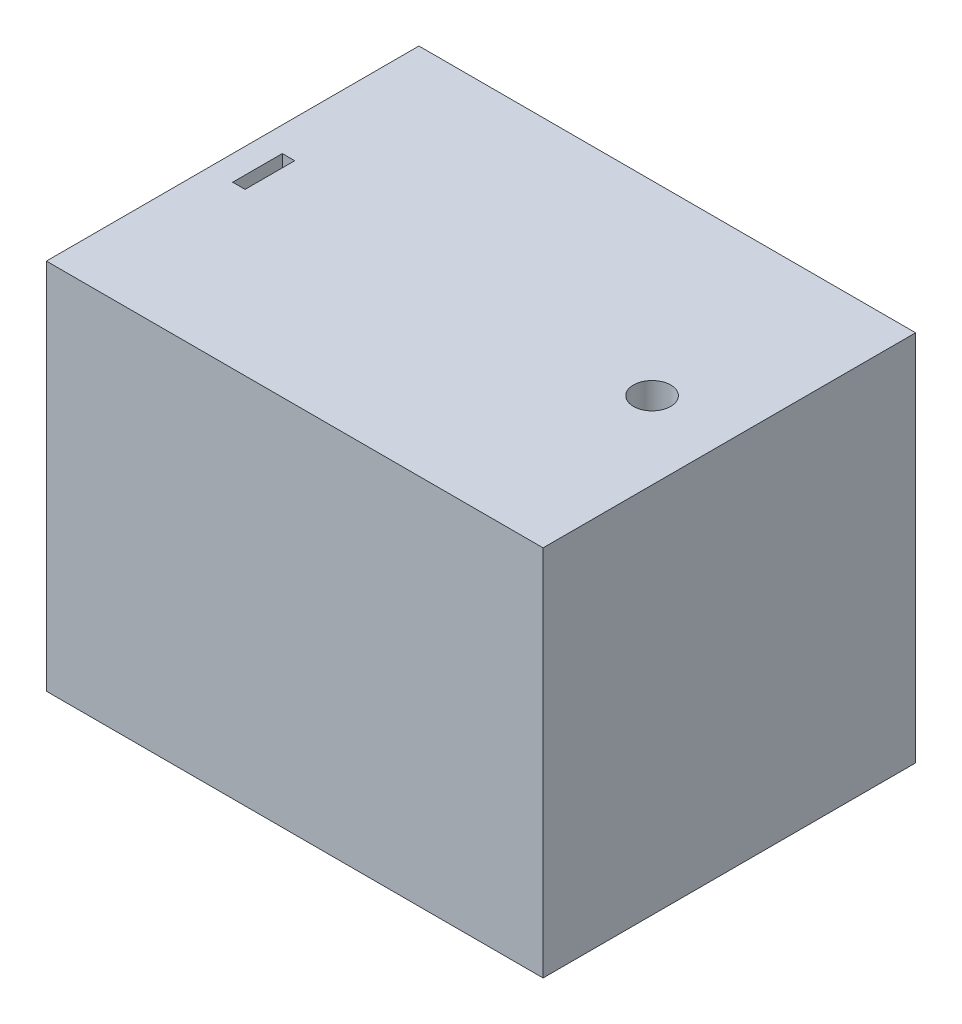
ISO-10303-21;
HEADER;
FILE_DESCRIPTION(('STEP AP214'),'2;1');
FILE_NAME('part.step','',(''),(''),'','','');
FILE_SCHEMA(('AUTOMOTIVE_DESIGN { 1 0 10303 214 1 1 1 1 }'));
ENDSEC;
DATA;
#1=APPLICATION_CONTEXT('core data for automotive mechanical design processes');
#2=APPLICATION_PROTOCOL_DEFINITION('international standard','automotive_design',2000,#1);
#3=PRODUCT_CONTEXT('',#1,'mechanical');
#4=PRODUCT('Part','Part','',(#3));
#5=PRODUCT_RELATED_PRODUCT_CATEGORY('part','',(#4));
#6=PRODUCT_DEFINITION_FORMATION('','',#4);
#7=PRODUCT_DEFINITION_CONTEXT('part definition',#1,'design');
#8=PRODUCT_DEFINITION('design','',#6,#7);
#9=PRODUCT_DEFINITION_SHAPE('','',#8);
#10=(LENGTH_UNIT() NAMED_UNIT(*) SI_UNIT(.MILLI.,.METRE.));
#11=(NAMED_UNIT(*) PLANE_ANGLE_UNIT() SI_UNIT($,.RADIAN.));
#12=(NAMED_UNIT(*) SI_UNIT($,.STERADIAN.) SOLID_ANGLE_UNIT());
#13=UNCERTAINTY_MEASURE_WITH_UNIT(LENGTH_MEASURE(1.E-05),#10,'distance_accuracy_value','');
#14=(GEOMETRIC_REPRESENTATION_CONTEXT(3) GLOBAL_UNCERTAINTY_ASSIGNED_CONTEXT((#13)) GLOBAL_UNIT_ASSIGNED_CONTEXT((#10,
#11,#12)) REPRESENTATION_CONTEXT('',''));
#15=CARTESIAN_POINT('',(0.,0.,0.));
#16=DIRECTION('',(0.,0.,1.));
#17=DIRECTION('',(1.,0.,0.));
#18=AXIS2_PLACEMENT_3D('',#15,#16,#17);
#19=CARTESIAN_POINT('',(0.,15.,0.));
#20=DIRECTION('',(1.,0.,0.));
#21=DIRECTION('',(0.,0.,-1.));
#22=AXIS2_PLACEMENT_3D('',#19,#20,#21);
#23=PLANE('',#22);
#24=DIRECTION('',(0.,0.,1.));
#25=VECTOR('',#24,1.);
#26=CARTESIAN_POINT('',(0.,0.,0.));
#27=LINE('',#26,#25);
#28=CARTESIAN_POINT('',(0.,0.,0.));
#29=VERTEX_POINT('',#28);
#30=CARTESIAN_POINT('',(0.,0.,15.));
#31=VERTEX_POINT('',#30);
#32=EDGE_CURVE('E167',#29,#31,#27,.T.);
#33=ORIENTED_EDGE('',*,*,#32,.T.);
#34=DIRECTION('',(0.,-1.,0.));
#35=VECTOR('',#34,1.);
#36=CARTESIAN_POINT('',(0.,15.,15.));
#37=LINE('',#36,#35);
#38=CARTESIAN_POINT('',(0.,15.,15.));
#39=VERTEX_POINT('',#38);
#40=EDGE_CURVE('E11',#39,#31,#37,.T.);
#41=ORIENTED_EDGE('',*,*,#40,.F.);
#42=DIRECTION('',(0.,0.,1.));
#43=VECTOR('',#42,1.);
#44=CARTESIAN_POINT('',(0.,15.,0.));
#45=LINE('',#44,#43);
#46=CARTESIAN_POINT('',(0.,15.,0.));
#47=VERTEX_POINT('',#46);
#48=EDGE_CURVE('E171',#47,#39,#45,.T.);
#49=ORIENTED_EDGE('',*,*,#48,.F.);
#50=DIRECTION('',(0.,-1.,0.));
#51=VECTOR('',#50,1.);
#52=CARTESIAN_POINT('',(0.,15.,0.));
#53=LINE('',#52,#51);
#54=EDGE_CURVE('E181',#47,#29,#53,.T.);
#55=ORIENTED_EDGE('',*,*,#54,.T.);
#56=EDGE_LOOP('',(#33,#41,#49,#55));
#57=FACE_BOUND('',#56,.T.);
#58=ADVANCED_FACE('F39',(#57),#23,.F.);
#59=CARTESIAN_POINT('',(0.,15.,15.));
#60=DIRECTION('',(0.,0.,-1.));
#61=DIRECTION('',(-1.,0.,0.));
#62=AXIS2_PLACEMENT_3D('',#59,#60,#61);
#63=PLANE('',#62);
#64=DIRECTION('',(1.,0.,0.));
#65=VECTOR('',#64,1.);
#66=CARTESIAN_POINT('',(0.,0.,15.));
#67=LINE('',#66,#65);
#68=CARTESIAN_POINT('',(20.,0.,15.));
#69=VERTEX_POINT('',#68);
#70=EDGE_CURVE('E185',#31,#69,#67,.T.);
#71=ORIENTED_EDGE('',*,*,#70,.T.);
#72=DIRECTION('',(0.,-1.,0.));
#73=VECTOR('',#72,1.);
#74=CARTESIAN_POINT('',(20.,15.,15.));
#75=LINE('',#74,#73);
#76=CARTESIAN_POINT('',(20.,15.,15.));
#77=VERTEX_POINT('',#76);
#78=EDGE_CURVE('E47',#77,#69,#75,.T.);
#79=ORIENTED_EDGE('',*,*,#78,.F.);
#80=DIRECTION('',(1.,0.,0.));
#81=VECTOR('',#80,1.);
#82=CARTESIAN_POINT('',(0.,15.,15.));
#83=LINE('',#82,#81);
#84=EDGE_CURVE('E91',#39,#77,#83,.T.);
#85=ORIENTED_EDGE('',*,*,#84,.F.);
#86=ORIENTED_EDGE('',*,*,#40,.T.);
#87=EDGE_LOOP('',(#71,#79,#85,#86));
#88=FACE_BOUND('',#87,.T.);
#89=ADVANCED_FACE('F220',(#88),#63,.F.);
#90=CARTESIAN_POINT('',(20.,15.,0.));
#91=DIRECTION('',(-1.,0.,0.));
#92=DIRECTION('',(0.,0.,1.));
#93=AXIS2_PLACEMENT_3D('',#90,#91,#92);
#94=PLANE('',#93);
#95=DIRECTION('',(0.,0.,-1.));
#96=VECTOR('',#95,1.);
#97=CARTESIAN_POINT('',(20.,0.,0.));
#98=LINE('',#97,#96);
#99=CARTESIAN_POINT('',(20.,0.,0.));
#100=VERTEX_POINT('',#99);
#101=EDGE_CURVE('E188',#69,#100,#98,.T.);
#102=ORIENTED_EDGE('',*,*,#101,.T.);
#103=DIRECTION('',(0.,-1.,0.));
#104=VECTOR('',#103,1.);
#105=CARTESIAN_POINT('',(20.,15.,0.));
#106=LINE('',#105,#104);
#107=CARTESIAN_POINT('',(20.,15.,0.));
#108=VERTEX_POINT('',#107);
#109=EDGE_CURVE('E195',#108,#100,#106,.T.);
#110=ORIENTED_EDGE('',*,*,#109,.F.);
#111=DIRECTION('',(0.,0.,-1.));
#112=VECTOR('',#111,1.);
#113=CARTESIAN_POINT('',(20.,15.,0.));
#114=LINE('',#113,#112);
#115=EDGE_CURVE('E176',#77,#108,#114,.T.);
#116=ORIENTED_EDGE('',*,*,#115,.F.);
#117=ORIENTED_EDGE('',*,*,#78,.T.);
#118=EDGE_LOOP('',(#102,#110,#116,#117));
#119=FACE_BOUND('',#118,.T.);
#120=ADVANCED_FACE('F202',(#119),#94,.F.);
#121=CARTESIAN_POINT('',(0.,15.,0.));
#122=DIRECTION('',(0.,0.,1.));
#123=DIRECTION('',(1.,0.,0.));
#124=AXIS2_PLACEMENT_3D('',#121,#122,#123);
#125=PLANE('',#124);
#126=DIRECTION('',(-1.,0.,0.));
#127=VECTOR('',#126,1.);
#128=CARTESIAN_POINT('',(0.,0.,0.));
#129=LINE('',#128,#127);
#130=EDGE_CURVE('E84',#100,#29,#129,.T.);
#131=ORIENTED_EDGE('',*,*,#130,.T.);
#132=ORIENTED_EDGE('',*,*,#54,.F.);
#133=DIRECTION('',(-1.,0.,0.));
#134=VECTOR('',#133,1.);
#135=CARTESIAN_POINT('',(0.,15.,0.));
#136=LINE('',#135,#134);
#137=EDGE_CURVE('E63',#108,#47,#136,.T.);
#138=ORIENTED_EDGE('',*,*,#137,.F.);
#139=ORIENTED_EDGE('',*,*,#109,.T.);
#140=EDGE_LOOP('',(#131,#132,#138,#139));
#141=FACE_BOUND('',#140,.T.);
#142=ADVANCED_FACE('F210',(#141),#125,.F.);
#143=CARTESIAN_POINT('',(0.,15.,0.));
#144=DIRECTION('',(0.,1.,0.));
#145=DIRECTION('',(0.,0.,1.));
#146=AXIS2_PLACEMENT_3D('',#143,#144,#145);
#147=PLANE('',#146);
#148=DIRECTION('',(0.,0.,1.));
#149=VECTOR('',#148,1.);
#150=CARTESIAN_POINT('',(1.,15.,6.5));
#151=LINE('',#150,#149);
#152=CARTESIAN_POINT('',(1.,15.,6.5));
#153=VERTEX_POINT('',#152);
#154=CARTESIAN_POINT('',(1.,15.,8.5));
#155=VERTEX_POINT('',#154);
#156=EDGE_CURVE('E54',#153,#155,#151,.T.);
#157=ORIENTED_EDGE('',*,*,#156,.F.);
#158=DIRECTION('',(1.,0.,0.));
#159=VECTOR('',#158,1.);
#160=CARTESIAN_POINT('',(1.,15.,6.5));
#161=LINE('',#160,#159);
#162=CARTESIAN_POINT('',(1.5,15.,6.5));
#163=VERTEX_POINT('',#162);
#164=EDGE_CURVE('E135',#153,#163,#161,.T.);
#165=ORIENTED_EDGE('',*,*,#164,.T.);
#166=DIRECTION('',(0.,0.,1.));
#167=VECTOR('',#166,1.);
#168=CARTESIAN_POINT('',(1.5,15.,6.5));
#169=LINE('',#168,#167);
#170=CARTESIAN_POINT('',(1.5,15.,8.5));
#171=VERTEX_POINT('',#170);
#172=EDGE_CURVE('E139',#163,#171,#169,.T.);
#173=ORIENTED_EDGE('',*,*,#172,.T.);
#174=DIRECTION('',(1.,0.,0.));
#175=VECTOR('',#174,1.);
#176=CARTESIAN_POINT('',(1.,15.,8.5));
#177=LINE('',#176,#175);
#178=EDGE_CURVE('E148',#155,#171,#177,.T.);
#179=ORIENTED_EDGE('',*,*,#178,.F.);
#180=EDGE_LOOP('',(#157,#165,#173,#179));
#181=FACE_BOUND('',#180,.T.);
#182=CARTESIAN_POINT('',(16.8886235381611,15.,7.5));
#183=DIRECTION('',(0.,1.,0.));
#184=DIRECTION('',(0.,0.,1.));
#185=AXIS2_PLACEMENT_3D('',#182,#183,#184);
#186=CIRCLE('',#185,0.750000000000002);
#187=CARTESIAN_POINT('',(16.8886235381611,15.,8.25));
#188=VERTEX_POINT('',#187);
#189=EDGE_CURVE('E157',#188,#188,#186,.T.);
#190=ORIENTED_EDGE('',*,*,#189,.F.);
#191=EDGE_LOOP('',(#190));
#192=FACE_BOUND('',#191,.T.);
#193=ORIENTED_EDGE('',*,*,#48,.T.);
#194=ORIENTED_EDGE('',*,*,#84,.T.);
#195=ORIENTED_EDGE('',*,*,#115,.T.);
#196=ORIENTED_EDGE('',*,*,#137,.T.);
#197=EDGE_LOOP('',(#193,#194,#195,#196));
#198=FACE_BOUND('',#197,.T.);
#199=ADVANCED_FACE('F212',(#181,#192,#198),#147,.T.);
#200=CARTESIAN_POINT('',(0.,0.,0.));
#201=DIRECTION('',(0.,1.,0.));
#202=DIRECTION('',(0.,0.,1.));
#203=AXIS2_PLACEMENT_3D('',#200,#201,#202);
#204=PLANE('',#203);
#205=CARTESIAN_POINT('',(16.8886235381611,0.,7.5));
#206=DIRECTION('',(0.,1.,0.));
#207=DIRECTION('',(0.,0.,1.));
#208=AXIS2_PLACEMENT_3D('',#205,#206,#207);
#209=CIRCLE('',#208,0.750000000000002);
#210=CARTESIAN_POINT('',(16.8886235381611,0.,8.25));
#211=VERTEX_POINT('',#210);
#212=EDGE_CURVE('E163',#211,#211,#209,.T.);
#213=ORIENTED_EDGE('',*,*,#212,.T.);
#214=EDGE_LOOP('',(#213));
#215=FACE_BOUND('',#214,.T.);
#216=ORIENTED_EDGE('',*,*,#32,.F.);
#217=ORIENTED_EDGE('',*,*,#130,.F.);
#218=ORIENTED_EDGE('',*,*,#101,.F.);
#219=ORIENTED_EDGE('',*,*,#70,.F.);
#220=EDGE_LOOP('',(#216,#217,#218,#219));
#221=FACE_BOUND('',#220,.T.);
#222=ADVANCED_FACE('F206',(#215,#221),#204,.F.);
#223=CARTESIAN_POINT('',(16.8886235381611,0.,7.5));
#224=DIRECTION('',(0.,1.,0.));
#225=DIRECTION('',(0.,0.,1.));
#226=AXIS2_PLACEMENT_3D('',#223,#224,#225);
#227=CYLINDRICAL_SURFACE('',#226,0.750000000000002);
#228=ORIENTED_EDGE('',*,*,#212,.F.);
#229=EDGE_LOOP('',(#228));
#230=FACE_BOUND('',#229,.T.);
#231=ORIENTED_EDGE('',*,*,#189,.T.);
#232=EDGE_LOOP('',(#231));
#233=FACE_BOUND('',#232,.T.);
#234=ADVANCED_FACE('F247',(#230,#233),#227,.F.);
#235=CARTESIAN_POINT('',(1.,8.,6.5));
#236=DIRECTION('',(-1.,0.,0.));
#237=DIRECTION('',(0.,0.,1.));
#238=AXIS2_PLACEMENT_3D('',#235,#236,#237);
#239=PLANE('',#238);
#240=ORIENTED_EDGE('',*,*,#156,.T.);
#241=DIRECTION('',(0.,1.,0.));
#242=VECTOR('',#241,1.);
#243=CARTESIAN_POINT('',(1.,8.,8.5));
#244=LINE('',#243,#242);
#245=CARTESIAN_POINT('',(1.,8.,8.5));
#246=VERTEX_POINT('',#245);
#247=EDGE_CURVE('E111',#246,#155,#244,.T.);
#248=ORIENTED_EDGE('',*,*,#247,.F.);
#249=DIRECTION('',(0.,0.,1.));
#250=VECTOR('',#249,1.);
#251=CARTESIAN_POINT('',(1.,8.,6.5));
#252=LINE('',#251,#250);
#253=CARTESIAN_POINT('',(1.,8.,6.5));
#254=VERTEX_POINT('',#253);
#255=EDGE_CURVE('E115',#254,#246,#252,.T.);
#256=ORIENTED_EDGE('',*,*,#255,.F.);
#257=DIRECTION('',(0.,1.,0.));
#258=VECTOR('',#257,1.);
#259=CARTESIAN_POINT('',(1.,8.,6.5));
#260=LINE('',#259,#258);
#261=EDGE_CURVE('E154',#254,#153,#260,.T.);
#262=ORIENTED_EDGE('',*,*,#261,.T.);
#263=EDGE_LOOP('',(#240,#248,#256,#262));
#264=FACE_BOUND('',#263,.T.);
#265=ADVANCED_FACE('F113',(#264),#239,.F.);
#266=CARTESIAN_POINT('',(1.,8.,6.5));
#267=DIRECTION('',(0.,0.,1.));
#268=DIRECTION('',(1.,0.,0.));
#269=AXIS2_PLACEMENT_3D('',#266,#267,#268);
#270=PLANE('',#269);
#271=ORIENTED_EDGE('',*,*,#164,.F.);
#272=ORIENTED_EDGE('',*,*,#261,.F.);
#273=DIRECTION('',(1.,0.,0.));
#274=VECTOR('',#273,1.);
#275=CARTESIAN_POINT('',(1.,8.,6.5));
#276=LINE('',#275,#274);
#277=CARTESIAN_POINT('',(1.5,8.,6.5));
#278=VERTEX_POINT('',#277);
#279=EDGE_CURVE('E121',#254,#278,#276,.T.);
#280=ORIENTED_EDGE('',*,*,#279,.T.);
#281=DIRECTION('',(0.,1.,0.));
#282=VECTOR('',#281,1.);
#283=CARTESIAN_POINT('',(1.5,8.,6.5));
#284=LINE('',#283,#282);
#285=EDGE_CURVE('E158',#278,#163,#284,.T.);
#286=ORIENTED_EDGE('',*,*,#285,.T.);
#287=EDGE_LOOP('',(#271,#272,#280,#286));
#288=FACE_BOUND('',#287,.T.);
#289=ADVANCED_FACE('F270',(#288),#270,.T.);
#290=CARTESIAN_POINT('',(1.5,8.,6.5));
#291=DIRECTION('',(-1.,0.,0.));
#292=DIRECTION('',(0.,0.,1.));
#293=AXIS2_PLACEMENT_3D('',#290,#291,#292);
#294=PLANE('',#293);
#295=ORIENTED_EDGE('',*,*,#172,.F.);
#296=ORIENTED_EDGE('',*,*,#285,.F.);
#297=DIRECTION('',(0.,0.,1.));
#298=VECTOR('',#297,1.);
#299=CARTESIAN_POINT('',(1.5,8.,6.5));
#300=LINE('',#299,#298);
#301=CARTESIAN_POINT('',(1.5,8.,8.5));
#302=VERTEX_POINT('',#301);
#303=EDGE_CURVE('E130',#278,#302,#300,.T.);
#304=ORIENTED_EDGE('',*,*,#303,.T.);
#305=DIRECTION('',(0.,1.,0.));
#306=VECTOR('',#305,1.);
#307=CARTESIAN_POINT('',(1.5,8.,8.5));
#308=LINE('',#307,#306);
#309=EDGE_CURVE('E120',#302,#171,#308,.T.);
#310=ORIENTED_EDGE('',*,*,#309,.T.);
#311=EDGE_LOOP('',(#295,#296,#304,#310));
#312=FACE_BOUND('',#311,.T.);
#313=ADVANCED_FACE('F279',(#312),#294,.T.);
#314=CARTESIAN_POINT('',(1.,8.,8.5));
#315=DIRECTION('',(0.,0.,1.));
#316=DIRECTION('',(1.,0.,0.));
#317=AXIS2_PLACEMENT_3D('',#314,#315,#316);
#318=PLANE('',#317);
#319=ORIENTED_EDGE('',*,*,#178,.T.);
#320=ORIENTED_EDGE('',*,*,#309,.F.);
#321=DIRECTION('',(1.,0.,0.));
#322=VECTOR('',#321,1.);
#323=CARTESIAN_POINT('',(1.,8.,8.5));
#324=LINE('',#323,#322);
#325=EDGE_CURVE('E125',#246,#302,#324,.T.);
#326=ORIENTED_EDGE('',*,*,#325,.F.);
#327=ORIENTED_EDGE('',*,*,#247,.T.);
#328=EDGE_LOOP('',(#319,#320,#326,#327));
#329=FACE_BOUND('',#328,.T.);
#330=ADVANCED_FACE('F126',(#329),#318,.F.);
#331=CARTESIAN_POINT('',(0.,8.,0.));
#332=DIRECTION('',(0.,1.,0.));
#333=DIRECTION('',(0.,0.,1.));
#334=AXIS2_PLACEMENT_3D('',#331,#332,#333);
#335=PLANE('',#334);
#336=ORIENTED_EDGE('',*,*,#255,.T.);
#337=ORIENTED_EDGE('',*,*,#325,.T.);
#338=ORIENTED_EDGE('',*,*,#303,.F.);
#339=ORIENTED_EDGE('',*,*,#279,.F.);
#340=EDGE_LOOP('',(#336,#337,#338,#339));
#341=FACE_BOUND('',#340,.T.);
#342=ADVANCED_FACE('F133',(#341),#335,.T.);
#343=CLOSED_SHELL('',(#58,#89,#120,#142,#199,#222,#234,#265,#289,#313,#330,#342));
#344=MANIFOLD_SOLID_BREP('B2',#343);
#345=ADVANCED_BREP_SHAPE_REPRESENTATION('',(#18,#344),#14);
#346=SHAPE_DEFINITION_REPRESENTATION(#9,#345);
ENDSEC;
END-ISO-10303-21;
